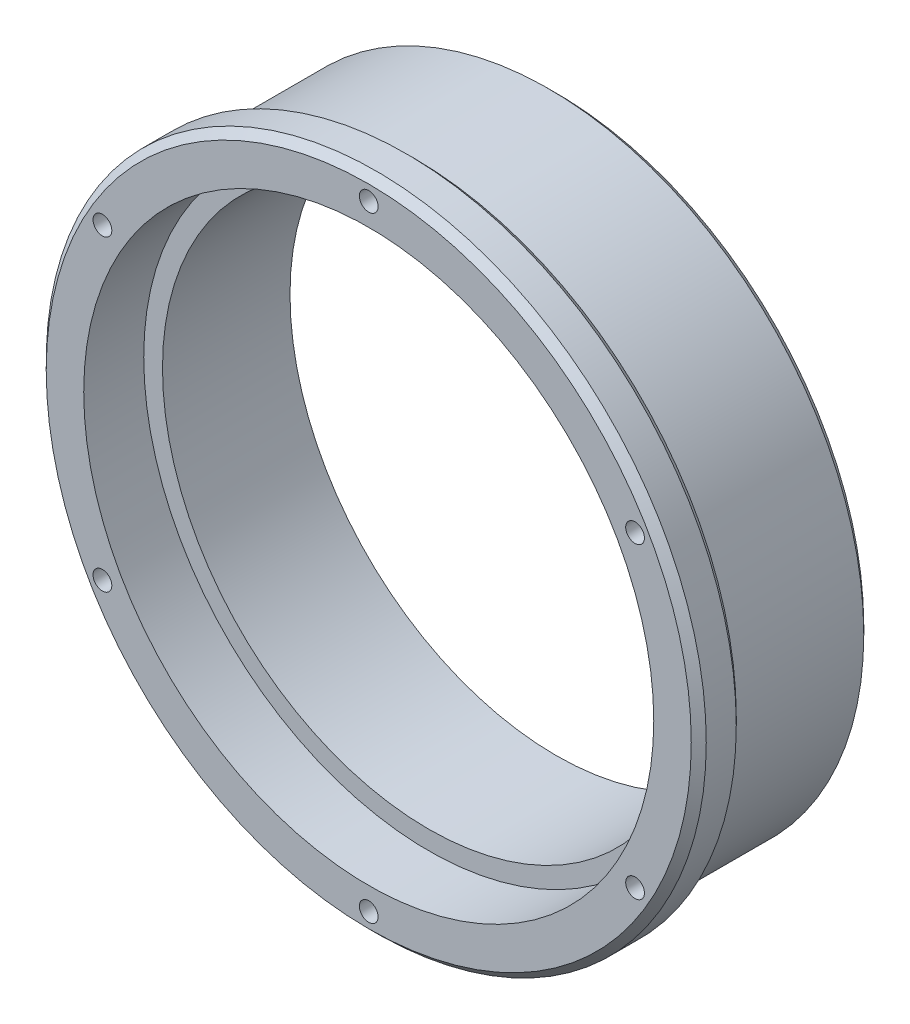
ISO-10303-21;
HEADER;
FILE_DESCRIPTION(('STEP AP214'),'2;1');
FILE_NAME('part.step','',(''),(''),'','','');
FILE_SCHEMA(('AUTOMOTIVE_DESIGN { 1 0 10303 214 1 1 1 1 }'));
ENDSEC;
DATA;
#1=APPLICATION_CONTEXT('core data for automotive mechanical design processes');
#2=APPLICATION_PROTOCOL_DEFINITION('international standard','automotive_design',2000,#1);
#3=PRODUCT_CONTEXT('',#1,'mechanical');
#4=PRODUCT('Part','Part','',(#3));
#5=PRODUCT_RELATED_PRODUCT_CATEGORY('part','',(#4));
#6=PRODUCT_DEFINITION_FORMATION('','',#4);
#7=PRODUCT_DEFINITION_CONTEXT('part definition',#1,'design');
#8=PRODUCT_DEFINITION('design','',#6,#7);
#9=PRODUCT_DEFINITION_SHAPE('','',#8);
#10=(LENGTH_UNIT() NAMED_UNIT(*) SI_UNIT(.MILLI.,.METRE.));
#11=(NAMED_UNIT(*) PLANE_ANGLE_UNIT() SI_UNIT($,.RADIAN.));
#12=(NAMED_UNIT(*) SI_UNIT($,.STERADIAN.) SOLID_ANGLE_UNIT());
#13=UNCERTAINTY_MEASURE_WITH_UNIT(LENGTH_MEASURE(1.E-05),#10,'distance_accuracy_value','');
#14=(GEOMETRIC_REPRESENTATION_CONTEXT(3) GLOBAL_UNCERTAINTY_ASSIGNED_CONTEXT((#13)) GLOBAL_UNIT_ASSIGNED_CONTEXT((#10,
#11,#12)) REPRESENTATION_CONTEXT('',''));
#15=CARTESIAN_POINT('',(0.,0.,0.));
#16=DIRECTION('',(0.,0.,1.));
#17=DIRECTION('',(1.,0.,0.));
#18=AXIS2_PLACEMENT_3D('',#15,#16,#17);
#19=CARTESIAN_POINT('',(0.,0.,25.));
#20=DIRECTION('',(0.,0.,-1.));
#21=DIRECTION('',(-1.,0.,0.));
#22=AXIS2_PLACEMENT_3D('',#19,#20,#21);
#23=CYLINDRICAL_SURFACE('',#22,42.);
#24=CARTESIAN_POINT('',(0.,0.,0.999999999999987));
#25=DIRECTION('',(0.,0.,1.));
#26=DIRECTION('',(1.,0.,0.));
#27=AXIS2_PLACEMENT_3D('',#24,#25,#26);
#28=CIRCLE('',#27,42.);
#29=CARTESIAN_POINT('',(42.,0.,0.999999999999987));
#30=VERTEX_POINT('',#29);
#31=EDGE_CURVE('E181',#30,#30,#28,.T.);
#32=ORIENTED_EDGE('',*,*,#31,.T.);
#33=EDGE_LOOP('',(#32));
#34=FACE_BOUND('',#33,.T.);
#35=CARTESIAN_POINT('',(0.,0.,19.));
#36=DIRECTION('',(0.,0.,1.));
#37=DIRECTION('',(1.,0.,0.));
#38=AXIS2_PLACEMENT_3D('',#35,#36,#37);
#39=CIRCLE('',#38,42.);
#40=CARTESIAN_POINT('',(42.,0.,19.));
#41=VERTEX_POINT('',#40);
#42=EDGE_CURVE('E176',#41,#41,#39,.T.);
#43=ORIENTED_EDGE('',*,*,#42,.F.);
#44=EDGE_LOOP('',(#43));
#45=FACE_BOUND('',#44,.T.);
#46=ADVANCED_FACE('F40',(#34,#45),#23,.T.);
#47=CARTESIAN_POINT('',(0.,0.,25.));
#48=DIRECTION('',(0.,0.,-1.));
#49=DIRECTION('',(-1.,0.,0.));
#50=AXIS2_PLACEMENT_3D('',#47,#48,#49);
#51=CYLINDRICAL_SURFACE('',#50,35.5);
#52=CARTESIAN_POINT('',(0.,0.,0.));
#53=DIRECTION('',(0.,0.,1.));
#54=DIRECTION('',(1.,0.,0.));
#55=AXIS2_PLACEMENT_3D('',#52,#53,#54);
#56=CIRCLE('',#55,35.5);
#57=CARTESIAN_POINT('',(35.5,0.,0.));
#58=VERTEX_POINT('',#57);
#59=EDGE_CURVE('E173',#58,#58,#56,.T.);
#60=ORIENTED_EDGE('',*,*,#59,.F.);
#61=EDGE_LOOP('',(#60));
#62=FACE_BOUND('',#61,.T.);
#63=CARTESIAN_POINT('',(0.,0.,17.));
#64=DIRECTION('',(0.,0.,1.));
#65=DIRECTION('',(1.,0.,0.));
#66=AXIS2_PLACEMENT_3D('',#63,#64,#65);
#67=CIRCLE('',#66,35.5);
#68=CARTESIAN_POINT('',(35.5,0.,17.));
#69=VERTEX_POINT('',#68);
#70=EDGE_CURVE('E170',#69,#69,#67,.T.);
#71=ORIENTED_EDGE('',*,*,#70,.T.);
#72=EDGE_LOOP('',(#71));
#73=FACE_BOUND('',#72,.T.);
#74=ADVANCED_FACE('F218',(#62,#73),#51,.F.);
#75=CARTESIAN_POINT('',(0.,0.,25.));
#76=DIRECTION('',(0.,0.,1.));
#77=DIRECTION('',(1.,0.,0.));
#78=AXIS2_PLACEMENT_3D('',#75,#76,#77);
#79=PLANE('',#78);
#80=CARTESIAN_POINT('',(0.,0.,25.));
#81=DIRECTION('',(0.,0.,1.));
#82=DIRECTION('',(1.,0.,0.));
#83=AXIS2_PLACEMENT_3D('',#80,#81,#82);
#84=CIRCLE('',#83,43.);
#85=CARTESIAN_POINT('',(43.,0.,25.));
#86=VERTEX_POINT('',#85);
#87=EDGE_CURVE('E11',#86,#86,#84,.T.);
#88=ORIENTED_EDGE('',*,*,#87,.T.);
#89=EDGE_LOOP('',(#88));
#90=FACE_BOUND('',#89,.T.);
#91=CARTESIAN_POINT('',(35.507041555162,20.5,25.));
#92=DIRECTION('',(0.,0.,1.));
#93=DIRECTION('',(1.,0.,0.));
#94=AXIS2_PLACEMENT_3D('',#91,#92,#93);
#95=CIRCLE('',#94,1.24999999999999);
#96=CARTESIAN_POINT('',(36.757041555162,20.5,25.));
#97=VERTEX_POINT('',#96);
#98=EDGE_CURVE('E96',#97,#97,#95,.T.);
#99=ORIENTED_EDGE('',*,*,#98,.F.);
#100=EDGE_LOOP('',(#99));
#101=FACE_BOUND('',#100,.T.);
#102=CARTESIAN_POINT('',(35.507041555162,-20.5,25.));
#103=DIRECTION('',(0.,0.,1.));
#104=DIRECTION('',(1.,0.,0.));
#105=AXIS2_PLACEMENT_3D('',#102,#103,#104);
#106=CIRCLE('',#105,1.24999999999999);
#107=CARTESIAN_POINT('',(36.757041555162,-20.5,25.));
#108=VERTEX_POINT('',#107);
#109=EDGE_CURVE('E95',#108,#108,#106,.T.);
#110=ORIENTED_EDGE('',*,*,#109,.F.);
#111=EDGE_LOOP('',(#110));
#112=FACE_BOUND('',#111,.T.);
#113=CARTESIAN_POINT('',(0.,41.,25.));
#114=DIRECTION('',(0.,0.,1.));
#115=DIRECTION('',(1.,0.,0.));
#116=AXIS2_PLACEMENT_3D('',#113,#114,#115);
#117=CIRCLE('',#116,1.24999999999999);
#118=CARTESIAN_POINT('',(1.24999999999999,41.,25.));
#119=VERTEX_POINT('',#118);
#120=EDGE_CURVE('E106',#119,#119,#117,.T.);
#121=ORIENTED_EDGE('',*,*,#120,.F.);
#122=EDGE_LOOP('',(#121));
#123=FACE_BOUND('',#122,.T.);
#124=CARTESIAN_POINT('',(0.,-41.,25.));
#125=DIRECTION('',(0.,0.,1.));
#126=DIRECTION('',(1.,0.,0.));
#127=AXIS2_PLACEMENT_3D('',#124,#125,#126);
#128=CIRCLE('',#127,1.24999999999999);
#129=CARTESIAN_POINT('',(1.24999999999999,-41.,25.));
#130=VERTEX_POINT('',#129);
#131=EDGE_CURVE('E112',#130,#130,#128,.T.);
#132=ORIENTED_EDGE('',*,*,#131,.F.);
#133=EDGE_LOOP('',(#132));
#134=FACE_BOUND('',#133,.T.);
#135=CARTESIAN_POINT('',(-35.507041555162,-20.5,25.));
#136=DIRECTION('',(0.,0.,1.));
#137=DIRECTION('',(1.,0.,0.));
#138=AXIS2_PLACEMENT_3D('',#135,#136,#137);
#139=CIRCLE('',#138,1.24999999999999);
#140=CARTESIAN_POINT('',(-34.257041555162,-20.5,25.));
#141=VERTEX_POINT('',#140);
#142=EDGE_CURVE('E118',#141,#141,#139,.T.);
#143=ORIENTED_EDGE('',*,*,#142,.F.);
#144=EDGE_LOOP('',(#143));
#145=FACE_BOUND('',#144,.T.);
#146=CARTESIAN_POINT('',(-35.507041555162,20.5,25.));
#147=DIRECTION('',(0.,0.,1.));
#148=DIRECTION('',(1.,0.,0.));
#149=AXIS2_PLACEMENT_3D('',#146,#147,#148);
#150=CIRCLE('',#149,1.24999999999999);
#151=CARTESIAN_POINT('',(-34.257041555162,20.5,25.));
#152=VERTEX_POINT('',#151);
#153=EDGE_CURVE('E124',#152,#152,#150,.T.);
#154=ORIENTED_EDGE('',*,*,#153,.F.);
#155=EDGE_LOOP('',(#154));
#156=FACE_BOUND('',#155,.T.);
#157=CARTESIAN_POINT('',(0.,0.,25.));
#158=DIRECTION('',(0.,0.,1.));
#159=DIRECTION('',(1.,0.,0.));
#160=AXIS2_PLACEMENT_3D('',#157,#158,#159);
#161=CIRCLE('',#160,38.);
#162=CARTESIAN_POINT('',(38.,0.,25.));
#163=VERTEX_POINT('',#162);
#164=EDGE_CURVE('E166',#163,#163,#161,.T.);
#165=ORIENTED_EDGE('',*,*,#164,.F.);
#166=EDGE_LOOP('',(#165));
#167=FACE_BOUND('',#166,.T.);
#168=ADVANCED_FACE('F214',(#90,#101,#112,#123,#134,#145,#156,#167),#79,.T.);
#169=CARTESIAN_POINT('',(0.,0.,0.));
#170=DIRECTION('',(0.,0.,1.));
#171=DIRECTION('',(1.,0.,0.));
#172=AXIS2_PLACEMENT_3D('',#169,#170,#171);
#173=PLANE('',#172);
#174=CARTESIAN_POINT('',(0.,0.,0.));
#175=DIRECTION('',(0.,0.,1.));
#176=DIRECTION('',(1.,0.,0.));
#177=AXIS2_PLACEMENT_3D('',#174,#175,#176);
#178=CIRCLE('',#177,41.);
#179=CARTESIAN_POINT('',(41.,0.,0.));
#180=VERTEX_POINT('',#179);
#181=EDGE_CURVE('E184',#180,#180,#178,.F.);
#182=ORIENTED_EDGE('',*,*,#181,.T.);
#183=EDGE_LOOP('',(#182));
#184=FACE_BOUND('',#183,.T.);
#185=CARTESIAN_POINT('',(-33.3419780457009,19.25,0.));
#186=DIRECTION('',(0.,0.,-1.));
#187=DIRECTION('',(-1.,0.,0.));
#188=AXIS2_PLACEMENT_3D('',#185,#186,#187);
#189=CIRCLE('',#188,1.24999999999999);
#190=CARTESIAN_POINT('',(-34.5919780457009,19.25,0.));
#191=VERTEX_POINT('',#190);
#192=EDGE_CURVE('E130',#191,#191,#189,.T.);
#193=ORIENTED_EDGE('',*,*,#192,.F.);
#194=EDGE_LOOP('',(#193));
#195=FACE_BOUND('',#194,.T.);
#196=CARTESIAN_POINT('',(-33.3419780457009,-19.25,0.));
#197=DIRECTION('',(0.,0.,-1.));
#198=DIRECTION('',(-1.,0.,0.));
#199=AXIS2_PLACEMENT_3D('',#196,#197,#198);
#200=CIRCLE('',#199,1.24999999999999);
#201=CARTESIAN_POINT('',(-34.5919780457009,-19.25,0.));
#202=VERTEX_POINT('',#201);
#203=EDGE_CURVE('E136',#202,#202,#200,.T.);
#204=ORIENTED_EDGE('',*,*,#203,.F.);
#205=EDGE_LOOP('',(#204));
#206=FACE_BOUND('',#205,.T.);
#207=CARTESIAN_POINT('',(0.,-38.5,0.));
#208=DIRECTION('',(0.,0.,-1.));
#209=DIRECTION('',(-1.,0.,0.));
#210=AXIS2_PLACEMENT_3D('',#207,#208,#209);
#211=CIRCLE('',#210,1.24999999999999);
#212=CARTESIAN_POINT('',(-1.24999999999999,-38.5,0.));
#213=VERTEX_POINT('',#212);
#214=EDGE_CURVE('E142',#213,#213,#211,.T.);
#215=ORIENTED_EDGE('',*,*,#214,.F.);
#216=EDGE_LOOP('',(#215));
#217=FACE_BOUND('',#216,.T.);
#218=CARTESIAN_POINT('',(33.3419780457009,-19.25,0.));
#219=DIRECTION('',(0.,0.,-1.));
#220=DIRECTION('',(-1.,0.,0.));
#221=AXIS2_PLACEMENT_3D('',#218,#219,#220);
#222=CIRCLE('',#221,1.24999999999999);
#223=CARTESIAN_POINT('',(32.0919780457009,-19.25,0.));
#224=VERTEX_POINT('',#223);
#225=EDGE_CURVE('E148',#224,#224,#222,.T.);
#226=ORIENTED_EDGE('',*,*,#225,.F.);
#227=EDGE_LOOP('',(#226));
#228=FACE_BOUND('',#227,.T.);
#229=CARTESIAN_POINT('',(33.3419780457009,19.25,0.));
#230=DIRECTION('',(0.,0.,-1.));
#231=DIRECTION('',(-1.,0.,0.));
#232=AXIS2_PLACEMENT_3D('',#229,#230,#231);
#233=CIRCLE('',#232,1.24999999999999);
#234=CARTESIAN_POINT('',(32.0919780457009,19.25,0.));
#235=VERTEX_POINT('',#234);
#236=EDGE_CURVE('E154',#235,#235,#233,.T.);
#237=ORIENTED_EDGE('',*,*,#236,.F.);
#238=EDGE_LOOP('',(#237));
#239=FACE_BOUND('',#238,.T.);
#240=CARTESIAN_POINT('',(0.,38.5,0.));
#241=DIRECTION('',(0.,0.,-1.));
#242=DIRECTION('',(-1.,0.,0.));
#243=AXIS2_PLACEMENT_3D('',#240,#241,#242);
#244=CIRCLE('',#243,1.24999999999999);
#245=CARTESIAN_POINT('',(-1.24999999999999,38.5,0.));
#246=VERTEX_POINT('',#245);
#247=EDGE_CURVE('E160',#246,#246,#244,.T.);
#248=ORIENTED_EDGE('',*,*,#247,.F.);
#249=EDGE_LOOP('',(#248));
#250=FACE_BOUND('',#249,.T.);
#251=ORIENTED_EDGE('',*,*,#59,.T.);
#252=EDGE_LOOP('',(#251));
#253=FACE_BOUND('',#252,.T.);
#254=ADVANCED_FACE('F217',(#184,#195,#206,#217,#228,#239,#250,#253),#173,.F.);
#255=CARTESIAN_POINT('',(0.,0.,17.));
#256=DIRECTION('',(0.,0.,1.));
#257=DIRECTION('',(1.,0.,0.));
#258=AXIS2_PLACEMENT_3D('',#255,#256,#257);
#259=CYLINDRICAL_SURFACE('',#258,38.);
#260=CARTESIAN_POINT('',(0.,0.,17.));
#261=DIRECTION('',(0.,0.,1.));
#262=DIRECTION('',(1.,0.,0.));
#263=AXIS2_PLACEMENT_3D('',#260,#261,#262);
#264=CIRCLE('',#263,38.);
#265=CARTESIAN_POINT('',(38.,0.,17.));
#266=VERTEX_POINT('',#265);
#267=EDGE_CURVE('E167',#266,#266,#264,.T.);
#268=ORIENTED_EDGE('',*,*,#267,.F.);
#269=EDGE_LOOP('',(#268));
#270=FACE_BOUND('',#269,.T.);
#271=ORIENTED_EDGE('',*,*,#164,.T.);
#272=EDGE_LOOP('',(#271));
#273=FACE_BOUND('',#272,.T.);
#274=ADVANCED_FACE('F234',(#270,#273),#259,.F.);
#275=CARTESIAN_POINT('',(0.,0.,17.));
#276=DIRECTION('',(0.,0.,1.));
#277=DIRECTION('',(1.,0.,0.));
#278=AXIS2_PLACEMENT_3D('',#275,#276,#277);
#279=PLANE('',#278);
#280=ORIENTED_EDGE('',*,*,#70,.F.);
#281=EDGE_LOOP('',(#280));
#282=FACE_BOUND('',#281,.T.);
#283=ORIENTED_EDGE('',*,*,#267,.T.);
#284=EDGE_LOOP('',(#283));
#285=FACE_BOUND('',#284,.T.);
#286=ADVANCED_FACE('F236',(#282,#285),#279,.T.);
#287=CARTESIAN_POINT('',(0.,38.5,6.));
#288=DIRECTION('',(0.,0.,-1.));
#289=DIRECTION('',(-1.,0.,0.));
#290=AXIS2_PLACEMENT_3D('',#287,#288,#289);
#291=CONICAL_SURFACE('',#290,1.25,1.02974425867665);
#292=CARTESIAN_POINT('',(0.,38.5,6.75107577378445));
#293=VERTEX_POINT('',#292);
#294=VERTEX_LOOP('',#293);
#295=FACE_BOUND('',#294,.T.);
#296=CARTESIAN_POINT('',(0.,38.5,6.));
#297=DIRECTION('',(0.,0.,-1.));
#298=DIRECTION('',(-1.,0.,0.));
#299=AXIS2_PLACEMENT_3D('',#296,#297,#298);
#300=CIRCLE('',#299,1.25);
#301=CARTESIAN_POINT('',(-1.25,38.5,6.));
#302=VERTEX_POINT('',#301);
#303=EDGE_CURVE('E163',#302,#302,#300,.T.);
#304=ORIENTED_EDGE('',*,*,#303,.T.);
#305=EDGE_LOOP('',(#304));
#306=FACE_BOUND('',#305,.T.);
#307=ADVANCED_FACE('F243',(#295,#306),#291,.F.);
#308=CARTESIAN_POINT('',(0.,38.5,0.));
#309=DIRECTION('',(0.,0.,-1.));
#310=DIRECTION('',(-1.,0.,0.));
#311=AXIS2_PLACEMENT_3D('',#308,#309,#310);
#312=CYLINDRICAL_SURFACE('',#311,1.24999999999999);
#313=ORIENTED_EDGE('',*,*,#303,.F.);
#314=EDGE_LOOP('',(#313));
#315=FACE_BOUND('',#314,.T.);
#316=ORIENTED_EDGE('',*,*,#247,.T.);
#317=EDGE_LOOP('',(#316));
#318=FACE_BOUND('',#317,.T.);
#319=ADVANCED_FACE('F292',(#315,#318),#312,.F.);
#320=CARTESIAN_POINT('',(33.3419780457009,19.25,6.));
#321=DIRECTION('',(0.,0.,-1.));
#322=DIRECTION('',(-1.,0.,0.));
#323=AXIS2_PLACEMENT_3D('',#320,#321,#322);
#324=CONICAL_SURFACE('',#323,1.25,1.02974425867666);
#325=CARTESIAN_POINT('',(33.3419780457009,19.25,6.75107577378445));
#326=VERTEX_POINT('',#325);
#327=VERTEX_LOOP('',#326);
#328=FACE_BOUND('',#327,.T.);
#329=CARTESIAN_POINT('',(33.3419780457009,19.25,6.));
#330=DIRECTION('',(0.,0.,-1.));
#331=DIRECTION('',(-1.,0.,0.));
#332=AXIS2_PLACEMENT_3D('',#329,#330,#331);
#333=CIRCLE('',#332,1.25);
#334=CARTESIAN_POINT('',(32.0919780457009,19.25,6.));
#335=VERTEX_POINT('',#334);
#336=EDGE_CURVE('E157',#335,#335,#333,.T.);
#337=ORIENTED_EDGE('',*,*,#336,.T.);
#338=EDGE_LOOP('',(#337));
#339=FACE_BOUND('',#338,.T.);
#340=ADVANCED_FACE('F294',(#328,#339),#324,.F.);
#341=CARTESIAN_POINT('',(33.3419780457009,19.25,0.));
#342=DIRECTION('',(0.,0.,-1.));
#343=DIRECTION('',(-1.,0.,0.));
#344=AXIS2_PLACEMENT_3D('',#341,#342,#343);
#345=CYLINDRICAL_SURFACE('',#344,1.24999999999999);
#346=ORIENTED_EDGE('',*,*,#336,.F.);
#347=EDGE_LOOP('',(#346));
#348=FACE_BOUND('',#347,.T.);
#349=ORIENTED_EDGE('',*,*,#236,.T.);
#350=EDGE_LOOP('',(#349));
#351=FACE_BOUND('',#350,.T.);
#352=ADVANCED_FACE('F301',(#348,#351),#345,.F.);
#353=CARTESIAN_POINT('',(33.3419780457009,-19.25,6.));
#354=DIRECTION('',(0.,0.,-1.));
#355=DIRECTION('',(-1.,0.,0.));
#356=AXIS2_PLACEMENT_3D('',#353,#354,#355);
#357=CONICAL_SURFACE('',#356,1.25,1.02974425867666);
#358=CARTESIAN_POINT('',(33.3419780457009,-19.25,6.75107577378445));
#359=VERTEX_POINT('',#358);
#360=VERTEX_LOOP('',#359);
#361=FACE_BOUND('',#360,.T.);
#362=CARTESIAN_POINT('',(33.3419780457009,-19.25,6.));
#363=DIRECTION('',(0.,0.,-1.));
#364=DIRECTION('',(-1.,0.,0.));
#365=AXIS2_PLACEMENT_3D('',#362,#363,#364);
#366=CIRCLE('',#365,1.25);
#367=CARTESIAN_POINT('',(32.0919780457009,-19.25,6.));
#368=VERTEX_POINT('',#367);
#369=EDGE_CURVE('E151',#368,#368,#366,.T.);
#370=ORIENTED_EDGE('',*,*,#369,.T.);
#371=EDGE_LOOP('',(#370));
#372=FACE_BOUND('',#371,.T.);
#373=ADVANCED_FACE('F308',(#361,#372),#357,.F.);
#374=CARTESIAN_POINT('',(33.3419780457009,-19.25,0.));
#375=DIRECTION('',(0.,0.,-1.));
#376=DIRECTION('',(-1.,0.,0.));
#377=AXIS2_PLACEMENT_3D('',#374,#375,#376);
#378=CYLINDRICAL_SURFACE('',#377,1.24999999999999);
#379=ORIENTED_EDGE('',*,*,#369,.F.);
#380=EDGE_LOOP('',(#379));
#381=FACE_BOUND('',#380,.T.);
#382=ORIENTED_EDGE('',*,*,#225,.T.);
#383=EDGE_LOOP('',(#382));
#384=FACE_BOUND('',#383,.T.);
#385=ADVANCED_FACE('F312',(#381,#384),#378,.F.);
#386=CARTESIAN_POINT('',(0.,-38.5,6.));
#387=DIRECTION('',(0.,0.,-1.));
#388=DIRECTION('',(-1.,0.,0.));
#389=AXIS2_PLACEMENT_3D('',#386,#387,#388);
#390=CONICAL_SURFACE('',#389,1.25,1.02974425867665);
#391=CARTESIAN_POINT('',(0.,-38.5,6.75107577378445));
#392=VERTEX_POINT('',#391);
#393=VERTEX_LOOP('',#392);
#394=FACE_BOUND('',#393,.T.);
#395=CARTESIAN_POINT('',(0.,-38.5,6.));
#396=DIRECTION('',(0.,0.,-1.));
#397=DIRECTION('',(-1.,0.,0.));
#398=AXIS2_PLACEMENT_3D('',#395,#396,#397);
#399=CIRCLE('',#398,1.25);
#400=CARTESIAN_POINT('',(-1.25,-38.5,6.));
#401=VERTEX_POINT('',#400);
#402=EDGE_CURVE('E145',#401,#401,#399,.T.);
#403=ORIENTED_EDGE('',*,*,#402,.T.);
#404=EDGE_LOOP('',(#403));
#405=FACE_BOUND('',#404,.T.);
#406=ADVANCED_FACE('F316',(#394,#405),#390,.F.);
#407=CARTESIAN_POINT('',(0.,-38.5,0.));
#408=DIRECTION('',(0.,0.,-1.));
#409=DIRECTION('',(-1.,0.,0.));
#410=AXIS2_PLACEMENT_3D('',#407,#408,#409);
#411=CYLINDRICAL_SURFACE('',#410,1.24999999999999);
#412=ORIENTED_EDGE('',*,*,#402,.F.);
#413=EDGE_LOOP('',(#412));
#414=FACE_BOUND('',#413,.T.);
#415=ORIENTED_EDGE('',*,*,#214,.T.);
#416=EDGE_LOOP('',(#415));
#417=FACE_BOUND('',#416,.T.);
#418=ADVANCED_FACE('F320',(#414,#417),#411,.F.);
#419=CARTESIAN_POINT('',(-33.3419780457009,-19.25,6.));
#420=DIRECTION('',(0.,0.,-1.));
#421=DIRECTION('',(-1.,0.,0.));
#422=AXIS2_PLACEMENT_3D('',#419,#420,#421);
#423=CONICAL_SURFACE('',#422,1.25,1.02974425867666);
#424=CARTESIAN_POINT('',(-33.3419780457009,-19.25,6.75107577378445));
#425=VERTEX_POINT('',#424);
#426=VERTEX_LOOP('',#425);
#427=FACE_BOUND('',#426,.T.);
#428=CARTESIAN_POINT('',(-33.3419780457009,-19.25,6.));
#429=DIRECTION('',(0.,0.,-1.));
#430=DIRECTION('',(-1.,0.,0.));
#431=AXIS2_PLACEMENT_3D('',#428,#429,#430);
#432=CIRCLE('',#431,1.25);
#433=CARTESIAN_POINT('',(-34.5919780457009,-19.25,6.));
#434=VERTEX_POINT('',#433);
#435=EDGE_CURVE('E139',#434,#434,#432,.T.);
#436=ORIENTED_EDGE('',*,*,#435,.T.);
#437=EDGE_LOOP('',(#436));
#438=FACE_BOUND('',#437,.T.);
#439=ADVANCED_FACE('F324',(#427,#438),#423,.F.);
#440=CARTESIAN_POINT('',(-33.3419780457009,-19.25,0.));
#441=DIRECTION('',(0.,0.,-1.));
#442=DIRECTION('',(-1.,0.,0.));
#443=AXIS2_PLACEMENT_3D('',#440,#441,#442);
#444=CYLINDRICAL_SURFACE('',#443,1.24999999999999);
#445=ORIENTED_EDGE('',*,*,#435,.F.);
#446=EDGE_LOOP('',(#445));
#447=FACE_BOUND('',#446,.T.);
#448=ORIENTED_EDGE('',*,*,#203,.T.);
#449=EDGE_LOOP('',(#448));
#450=FACE_BOUND('',#449,.T.);
#451=ADVANCED_FACE('F328',(#447,#450),#444,.F.);
#452=CARTESIAN_POINT('',(-33.3419780457009,19.25,6.));
#453=DIRECTION('',(0.,0.,-1.));
#454=DIRECTION('',(-1.,0.,0.));
#455=AXIS2_PLACEMENT_3D('',#452,#453,#454);
#456=CONICAL_SURFACE('',#455,1.25,1.02974425867666);
#457=CARTESIAN_POINT('',(-33.3419780457009,19.25,6.75107577378445));
#458=VERTEX_POINT('',#457);
#459=VERTEX_LOOP('',#458);
#460=FACE_BOUND('',#459,.T.);
#461=CARTESIAN_POINT('',(-33.3419780457009,19.25,6.));
#462=DIRECTION('',(0.,0.,-1.));
#463=DIRECTION('',(-1.,0.,0.));
#464=AXIS2_PLACEMENT_3D('',#461,#462,#463);
#465=CIRCLE('',#464,1.25);
#466=CARTESIAN_POINT('',(-34.5919780457009,19.25,6.));
#467=VERTEX_POINT('',#466);
#468=EDGE_CURVE('E133',#467,#467,#465,.T.);
#469=ORIENTED_EDGE('',*,*,#468,.T.);
#470=EDGE_LOOP('',(#469));
#471=FACE_BOUND('',#470,.T.);
#472=ADVANCED_FACE('F332',(#460,#471),#456,.F.);
#473=CARTESIAN_POINT('',(-33.3419780457009,19.25,0.));
#474=DIRECTION('',(0.,0.,-1.));
#475=DIRECTION('',(-1.,0.,0.));
#476=AXIS2_PLACEMENT_3D('',#473,#474,#475);
#477=CYLINDRICAL_SURFACE('',#476,1.24999999999999);
#478=ORIENTED_EDGE('',*,*,#468,.F.);
#479=EDGE_LOOP('',(#478));
#480=FACE_BOUND('',#479,.T.);
#481=ORIENTED_EDGE('',*,*,#192,.T.);
#482=EDGE_LOOP('',(#481));
#483=FACE_BOUND('',#482,.T.);
#484=ADVANCED_FACE('F206',(#480,#483),#477,.F.);
#485=CARTESIAN_POINT('',(0.,0.,19.));
#486=DIRECTION('',(0.,0.,1.));
#487=DIRECTION('',(1.,0.,0.));
#488=AXIS2_PLACEMENT_3D('',#485,#486,#487);
#489=CYLINDRICAL_SURFACE('',#488,44.);
#490=CARTESIAN_POINT('',(0.,0.,20.));
#491=DIRECTION('',(0.,0.,1.));
#492=DIRECTION('',(1.,0.,0.));
#493=AXIS2_PLACEMENT_3D('',#490,#491,#492);
#494=CIRCLE('',#493,44.);
#495=CARTESIAN_POINT('',(44.,0.,20.));
#496=VERTEX_POINT('',#495);
#497=EDGE_CURVE('E190',#496,#496,#494,.T.);
#498=ORIENTED_EDGE('',*,*,#497,.T.);
#499=EDGE_LOOP('',(#498));
#500=FACE_BOUND('',#499,.T.);
#501=CARTESIAN_POINT('',(0.,0.,24.));
#502=DIRECTION('',(0.,0.,1.));
#503=DIRECTION('',(1.,0.,0.));
#504=AXIS2_PLACEMENT_3D('',#501,#502,#503);
#505=CIRCLE('',#504,44.);
#506=CARTESIAN_POINT('',(44.,0.,24.));
#507=VERTEX_POINT('',#506);
#508=EDGE_CURVE('E187',#507,#507,#505,.F.);
#509=ORIENTED_EDGE('',*,*,#508,.T.);
#510=EDGE_LOOP('',(#509));
#511=FACE_BOUND('',#510,.T.);
#512=ADVANCED_FACE('F203',(#500,#511),#489,.T.);
#513=CARTESIAN_POINT('',(0.,0.,19.));
#514=DIRECTION('',(0.,0.,1.));
#515=DIRECTION('',(1.,0.,0.));
#516=AXIS2_PLACEMENT_3D('',#513,#514,#515);
#517=PLANE('',#516);
#518=CARTESIAN_POINT('',(0.,0.,19.));
#519=DIRECTION('',(0.,0.,1.));
#520=DIRECTION('',(1.,0.,0.));
#521=AXIS2_PLACEMENT_3D('',#518,#519,#520);
#522=CIRCLE('',#521,43.);
#523=CARTESIAN_POINT('',(43.,0.,19.));
#524=VERTEX_POINT('',#523);
#525=EDGE_CURVE('E48',#524,#524,#522,.F.);
#526=ORIENTED_EDGE('',*,*,#525,.T.);
#527=EDGE_LOOP('',(#526));
#528=FACE_BOUND('',#527,.T.);
#529=ORIENTED_EDGE('',*,*,#42,.T.);
#530=EDGE_LOOP('',(#529));
#531=FACE_BOUND('',#530,.T.);
#532=ADVANCED_FACE('F195',(#528,#531),#517,.F.);
#533=CARTESIAN_POINT('',(0.,0.,0.999999999999987));
#534=DIRECTION('',(0.,0.,1.));
#535=DIRECTION('',(1.,0.,0.));
#536=AXIS2_PLACEMENT_3D('',#533,#534,#535);
#537=CONICAL_SURFACE('',#536,42.,0.785398163397455);
#538=ORIENTED_EDGE('',*,*,#181,.F.);
#539=EDGE_LOOP('',(#538));
#540=FACE_BOUND('',#539,.T.);
#541=ORIENTED_EDGE('',*,*,#31,.F.);
#542=EDGE_LOOP('',(#541));
#543=FACE_BOUND('',#542,.T.);
#544=ADVANCED_FACE('F259',(#540,#543),#537,.T.);
#545=CARTESIAN_POINT('',(-35.507041555162,20.5,20.));
#546=DIRECTION('',(0.,0.,1.));
#547=DIRECTION('',(1.,0.,0.));
#548=AXIS2_PLACEMENT_3D('',#545,#546,#547);
#549=CONICAL_SURFACE('',#548,1.25,1.02974425867666);
#550=CARTESIAN_POINT('',(-35.507041555162,20.5,19.2489242262155));
#551=VERTEX_POINT('',#550);
#552=VERTEX_LOOP('',#551);
#553=FACE_BOUND('',#552,.T.);
#554=CARTESIAN_POINT('',(-35.507041555162,20.5,20.));
#555=DIRECTION('',(0.,0.,1.));
#556=DIRECTION('',(1.,0.,0.));
#557=AXIS2_PLACEMENT_3D('',#554,#555,#556);
#558=CIRCLE('',#557,1.25);
#559=CARTESIAN_POINT('',(-34.257041555162,20.5,20.));
#560=VERTEX_POINT('',#559);
#561=EDGE_CURVE('E127',#560,#560,#558,.T.);
#562=ORIENTED_EDGE('',*,*,#561,.T.);
#563=EDGE_LOOP('',(#562));
#564=FACE_BOUND('',#563,.T.);
#565=ADVANCED_FACE('F261',(#553,#564),#549,.F.);
#566=CARTESIAN_POINT('',(-35.507041555162,20.5,25.));
#567=DIRECTION('',(0.,0.,1.));
#568=DIRECTION('',(1.,0.,0.));
#569=AXIS2_PLACEMENT_3D('',#566,#567,#568);
#570=CYLINDRICAL_SURFACE('',#569,1.24999999999999);
#571=ORIENTED_EDGE('',*,*,#561,.F.);
#572=EDGE_LOOP('',(#571));
#573=FACE_BOUND('',#572,.T.);
#574=ORIENTED_EDGE('',*,*,#153,.T.);
#575=EDGE_LOOP('',(#574));
#576=FACE_BOUND('',#575,.T.);
#577=ADVANCED_FACE('F267',(#573,#576),#570,.F.);
#578=CARTESIAN_POINT('',(-35.507041555162,-20.5,20.));
#579=DIRECTION('',(0.,0.,1.));
#580=DIRECTION('',(1.,0.,0.));
#581=AXIS2_PLACEMENT_3D('',#578,#579,#580);
#582=CONICAL_SURFACE('',#581,1.25,1.02974425867666);
#583=CARTESIAN_POINT('',(-35.507041555162,-20.5,19.2489242262155));
#584=VERTEX_POINT('',#583);
#585=VERTEX_LOOP('',#584);
#586=FACE_BOUND('',#585,.T.);
#587=CARTESIAN_POINT('',(-35.507041555162,-20.5,20.));
#588=DIRECTION('',(0.,0.,1.));
#589=DIRECTION('',(1.,0.,0.));
#590=AXIS2_PLACEMENT_3D('',#587,#588,#589);
#591=CIRCLE('',#590,1.25);
#592=CARTESIAN_POINT('',(-34.257041555162,-20.5,20.));
#593=VERTEX_POINT('',#592);
#594=EDGE_CURVE('E121',#593,#593,#591,.T.);
#595=ORIENTED_EDGE('',*,*,#594,.T.);
#596=EDGE_LOOP('',(#595));
#597=FACE_BOUND('',#596,.T.);
#598=ADVANCED_FACE('F342',(#586,#597),#582,.F.);
#599=CARTESIAN_POINT('',(-35.507041555162,-20.5,25.));
#600=DIRECTION('',(0.,0.,1.));
#601=DIRECTION('',(1.,0.,0.));
#602=AXIS2_PLACEMENT_3D('',#599,#600,#601);
#603=CYLINDRICAL_SURFACE('',#602,1.24999999999999);
#604=ORIENTED_EDGE('',*,*,#594,.F.);
#605=EDGE_LOOP('',(#604));
#606=FACE_BOUND('',#605,.T.);
#607=ORIENTED_EDGE('',*,*,#142,.T.);
#608=EDGE_LOOP('',(#607));
#609=FACE_BOUND('',#608,.T.);
#610=ADVANCED_FACE('F346',(#606,#609),#603,.F.);
#611=CARTESIAN_POINT('',(0.,-41.,20.));
#612=DIRECTION('',(0.,0.,1.));
#613=DIRECTION('',(1.,0.,0.));
#614=AXIS2_PLACEMENT_3D('',#611,#612,#613);
#615=CONICAL_SURFACE('',#614,1.25,1.02974425867665);
#616=CARTESIAN_POINT('',(0.,-41.,19.2489242262155));
#617=VERTEX_POINT('',#616);
#618=VERTEX_LOOP('',#617);
#619=FACE_BOUND('',#618,.T.);
#620=CARTESIAN_POINT('',(0.,-41.,20.));
#621=DIRECTION('',(0.,0.,1.));
#622=DIRECTION('',(1.,0.,0.));
#623=AXIS2_PLACEMENT_3D('',#620,#621,#622);
#624=CIRCLE('',#623,1.25);
#625=CARTESIAN_POINT('',(1.25,-41.,20.));
#626=VERTEX_POINT('',#625);
#627=EDGE_CURVE('E115',#626,#626,#624,.T.);
#628=ORIENTED_EDGE('',*,*,#627,.T.);
#629=EDGE_LOOP('',(#628));
#630=FACE_BOUND('',#629,.T.);
#631=ADVANCED_FACE('F350',(#619,#630),#615,.F.);
#632=CARTESIAN_POINT('',(0.,-41.,25.));
#633=DIRECTION('',(0.,0.,1.));
#634=DIRECTION('',(1.,0.,0.));
#635=AXIS2_PLACEMENT_3D('',#632,#633,#634);
#636=CYLINDRICAL_SURFACE('',#635,1.24999999999999);
#637=ORIENTED_EDGE('',*,*,#627,.F.);
#638=EDGE_LOOP('',(#637));
#639=FACE_BOUND('',#638,.T.);
#640=ORIENTED_EDGE('',*,*,#131,.T.);
#641=EDGE_LOOP('',(#640));
#642=FACE_BOUND('',#641,.T.);
#643=ADVANCED_FACE('F354',(#639,#642),#636,.F.);
#644=CARTESIAN_POINT('',(0.,41.,20.));
#645=DIRECTION('',(0.,0.,1.));
#646=DIRECTION('',(1.,0.,0.));
#647=AXIS2_PLACEMENT_3D('',#644,#645,#646);
#648=CONICAL_SURFACE('',#647,1.25,1.02974425867665);
#649=CARTESIAN_POINT('',(0.,41.,19.2489242262155));
#650=VERTEX_POINT('',#649);
#651=VERTEX_LOOP('',#650);
#652=FACE_BOUND('',#651,.T.);
#653=CARTESIAN_POINT('',(0.,41.,20.));
#654=DIRECTION('',(0.,0.,1.));
#655=DIRECTION('',(1.,0.,0.));
#656=AXIS2_PLACEMENT_3D('',#653,#654,#655);
#657=CIRCLE('',#656,1.25);
#658=CARTESIAN_POINT('',(1.25,41.,20.));
#659=VERTEX_POINT('',#658);
#660=EDGE_CURVE('E109',#659,#659,#657,.T.);
#661=ORIENTED_EDGE('',*,*,#660,.T.);
#662=EDGE_LOOP('',(#661));
#663=FACE_BOUND('',#662,.T.);
#664=ADVANCED_FACE('F358',(#652,#663),#648,.F.);
#665=CARTESIAN_POINT('',(0.,41.,25.));
#666=DIRECTION('',(0.,0.,1.));
#667=DIRECTION('',(1.,0.,0.));
#668=AXIS2_PLACEMENT_3D('',#665,#666,#667);
#669=CYLINDRICAL_SURFACE('',#668,1.24999999999999);
#670=ORIENTED_EDGE('',*,*,#660,.F.);
#671=EDGE_LOOP('',(#670));
#672=FACE_BOUND('',#671,.T.);
#673=ORIENTED_EDGE('',*,*,#120,.T.);
#674=EDGE_LOOP('',(#673));
#675=FACE_BOUND('',#674,.T.);
#676=ADVANCED_FACE('F362',(#672,#675),#669,.F.);
#677=CARTESIAN_POINT('',(35.507041555162,-20.5,20.));
#678=DIRECTION('',(0.,0.,1.));
#679=DIRECTION('',(1.,0.,0.));
#680=AXIS2_PLACEMENT_3D('',#677,#678,#679);
#681=CONICAL_SURFACE('',#680,1.25,1.02974425867666);
#682=CARTESIAN_POINT('',(35.507041555162,-20.5,19.2489242262155));
#683=VERTEX_POINT('',#682);
#684=VERTEX_LOOP('',#683);
#685=FACE_BOUND('',#684,.T.);
#686=CARTESIAN_POINT('',(35.507041555162,-20.5,20.));
#687=DIRECTION('',(0.,0.,1.));
#688=DIRECTION('',(1.,0.,0.));
#689=AXIS2_PLACEMENT_3D('',#686,#687,#688);
#690=CIRCLE('',#689,1.25);
#691=CARTESIAN_POINT('',(36.757041555162,-20.5,20.));
#692=VERTEX_POINT('',#691);
#693=EDGE_CURVE('E99',#692,#692,#690,.T.);
#694=ORIENTED_EDGE('',*,*,#693,.T.);
#695=EDGE_LOOP('',(#694));
#696=FACE_BOUND('',#695,.T.);
#697=ADVANCED_FACE('F366',(#685,#696),#681,.F.);
#698=CARTESIAN_POINT('',(35.507041555162,-20.5,25.));
#699=DIRECTION('',(0.,0.,1.));
#700=DIRECTION('',(1.,0.,0.));
#701=AXIS2_PLACEMENT_3D('',#698,#699,#700);
#702=CYLINDRICAL_SURFACE('',#701,1.24999999999999);
#703=ORIENTED_EDGE('',*,*,#693,.F.);
#704=EDGE_LOOP('',(#703));
#705=FACE_BOUND('',#704,.T.);
#706=ORIENTED_EDGE('',*,*,#109,.T.);
#707=EDGE_LOOP('',(#706));
#708=FACE_BOUND('',#707,.T.);
#709=ADVANCED_FACE('F89',(#705,#708),#702,.F.);
#710=CARTESIAN_POINT('',(35.507041555162,20.5,20.));
#711=DIRECTION('',(0.,0.,1.));
#712=DIRECTION('',(1.,0.,0.));
#713=AXIS2_PLACEMENT_3D('',#710,#711,#712);
#714=CONICAL_SURFACE('',#713,1.25,1.02974425867666);
#715=CARTESIAN_POINT('',(35.507041555162,20.5,19.2489242262155));
#716=VERTEX_POINT('',#715);
#717=VERTEX_LOOP('',#716);
#718=FACE_BOUND('',#717,.T.);
#719=CARTESIAN_POINT('',(35.507041555162,20.5,20.));
#720=DIRECTION('',(0.,0.,1.));
#721=DIRECTION('',(1.,0.,0.));
#722=AXIS2_PLACEMENT_3D('',#719,#720,#721);
#723=CIRCLE('',#722,1.25);
#724=CARTESIAN_POINT('',(36.757041555162,20.5,20.));
#725=VERTEX_POINT('',#724);
#726=EDGE_CURVE('E93',#725,#725,#723,.T.);
#727=ORIENTED_EDGE('',*,*,#726,.T.);
#728=EDGE_LOOP('',(#727));
#729=FACE_BOUND('',#728,.T.);
#730=ADVANCED_FACE('F85',(#718,#729),#714,.F.);
#731=CARTESIAN_POINT('',(35.507041555162,20.5,25.));
#732=DIRECTION('',(0.,0.,1.));
#733=DIRECTION('',(1.,0.,0.));
#734=AXIS2_PLACEMENT_3D('',#731,#732,#733);
#735=CYLINDRICAL_SURFACE('',#734,1.24999999999999);
#736=ORIENTED_EDGE('',*,*,#726,.F.);
#737=EDGE_LOOP('',(#736));
#738=FACE_BOUND('',#737,.T.);
#739=ORIENTED_EDGE('',*,*,#98,.T.);
#740=EDGE_LOOP('',(#739));
#741=FACE_BOUND('',#740,.T.);
#742=ADVANCED_FACE('F88',(#738,#741),#735,.F.);
#743=CARTESIAN_POINT('',(0.,0.,20.));
#744=DIRECTION('',(0.,0.,1.));
#745=DIRECTION('',(1.,0.,0.));
#746=AXIS2_PLACEMENT_3D('',#743,#744,#745);
#747=CONICAL_SURFACE('',#746,44.,0.785398163397452);
#748=ORIENTED_EDGE('',*,*,#525,.F.);
#749=EDGE_LOOP('',(#748));
#750=FACE_BOUND('',#749,.T.);
#751=ORIENTED_EDGE('',*,*,#497,.F.);
#752=EDGE_LOOP('',(#751));
#753=FACE_BOUND('',#752,.T.);
#754=ADVANCED_FACE('F198',(#750,#753),#747,.T.);
#755=CARTESIAN_POINT('',(0.,0.,25.));
#756=DIRECTION('',(0.,0.,-1.));
#757=DIRECTION('',(-1.,0.,0.));
#758=AXIS2_PLACEMENT_3D('',#755,#756,#757);
#759=CONICAL_SURFACE('',#758,43.,0.785398163397441);
#760=ORIENTED_EDGE('',*,*,#508,.F.);
#761=EDGE_LOOP('',(#760));
#762=FACE_BOUND('',#761,.T.);
#763=ORIENTED_EDGE('',*,*,#87,.F.);
#764=EDGE_LOOP('',(#763));
#765=FACE_BOUND('',#764,.T.);
#766=ADVANCED_FACE('F42',(#762,#765),#759,.T.);
#767=CLOSED_SHELL('',(#46,#74,#168,#254,#274,#286,#307,#319,#340,#352,#373,#385,#406,#418,#439,
#451,#472,#484,#512,#532,#544,#565,#577,#598,#610,#631,#643,#664,#676,#697,#709,#730,#742,#754,#766));
#768=MANIFOLD_SOLID_BREP('B2',#767);
#769=ADVANCED_BREP_SHAPE_REPRESENTATION('',(#18,#768),#14);
#770=SHAPE_DEFINITION_REPRESENTATION(#9,#769);
ENDSEC;
END-ISO-10303-21;
